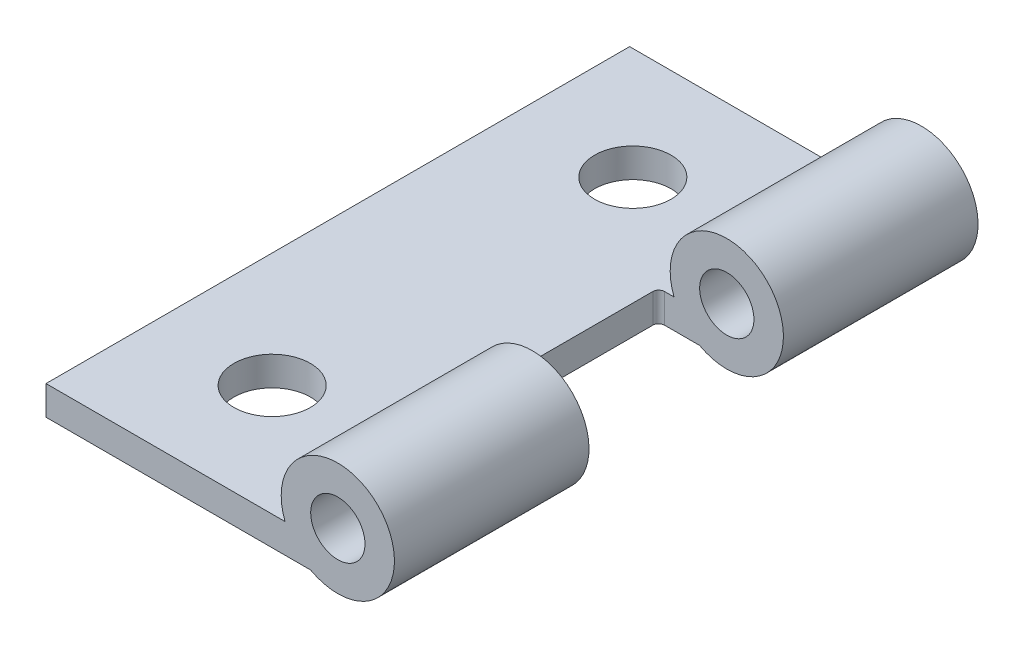
ISO-10303-21;
HEADER;
FILE_DESCRIPTION(('STEP AP214'),'2;1');
FILE_NAME('part.step','',(''),(''),'','','');
FILE_SCHEMA(('AUTOMOTIVE_DESIGN { 1 0 10303 214 1 1 1 1 }'));
ENDSEC;
DATA;
#1=APPLICATION_CONTEXT('core data for automotive mechanical design processes');
#2=APPLICATION_PROTOCOL_DEFINITION('international standard','automotive_design',2000,#1);
#3=PRODUCT_CONTEXT('',#1,'mechanical');
#4=PRODUCT('Part','Part','',(#3));
#5=PRODUCT_RELATED_PRODUCT_CATEGORY('part','',(#4));
#6=PRODUCT_DEFINITION_FORMATION('','',#4);
#7=PRODUCT_DEFINITION_CONTEXT('part definition',#1,'design');
#8=PRODUCT_DEFINITION('design','',#6,#7);
#9=PRODUCT_DEFINITION_SHAPE('','',#8);
#10=(LENGTH_UNIT() NAMED_UNIT(*) SI_UNIT(.MILLI.,.METRE.));
#11=(NAMED_UNIT(*) PLANE_ANGLE_UNIT() SI_UNIT($,.RADIAN.));
#12=(NAMED_UNIT(*) SI_UNIT($,.STERADIAN.) SOLID_ANGLE_UNIT());
#13=UNCERTAINTY_MEASURE_WITH_UNIT(LENGTH_MEASURE(1.E-05),#10,'distance_accuracy_value','');
#14=(GEOMETRIC_REPRESENTATION_CONTEXT(3) GLOBAL_UNCERTAINTY_ASSIGNED_CONTEXT((#13)) GLOBAL_UNIT_ASSIGNED_CONTEXT((#10,
#11,#12)) REPRESENTATION_CONTEXT('',''));
#15=CARTESIAN_POINT('',(0.,0.,0.));
#16=DIRECTION('',(0.,0.,1.));
#17=DIRECTION('',(1.,0.,0.));
#18=AXIS2_PLACEMENT_3D('',#15,#16,#17);
#19=CARTESIAN_POINT('',(-17.6276,2.61457636807809,-12.7));
#20=DIRECTION('',(0.,-1.,0.));
#21=DIRECTION('',(1.,0.,0.));
#22=AXIS2_PLACEMENT_3D('',#19,#20,#21);
#23=PLANE('',#22);
#24=CARTESIAN_POINT('',(-12.6365,2.61457636807809,-7.8486));
#25=DIRECTION('',(0.,-1.,0.));
#26=DIRECTION('',(1.,0.,0.));
#27=AXIS2_PLACEMENT_3D('',#24,#25,#26);
#28=CIRCLE('',#27,1.6637);
#29=CARTESIAN_POINT('',(-10.9728,2.6145763680781,-7.8486));
#30=VERTEX_POINT('',#29);
#31=EDGE_CURVE('E276',#30,#30,#28,.T.);
#32=ORIENTED_EDGE('',*,*,#31,.F.);
#33=EDGE_LOOP('',(#32));
#34=FACE_BOUND('',#33,.T.);
#35=CARTESIAN_POINT('',(-12.6365,2.61457636807809,7.8486));
#36=DIRECTION('',(0.,-1.,0.));
#37=DIRECTION('',(1.,0.,0.));
#38=AXIS2_PLACEMENT_3D('',#35,#36,#37);
#39=CIRCLE('',#38,1.6637);
#40=CARTESIAN_POINT('',(-10.9728,2.6145763680781,7.8486));
#41=VERTEX_POINT('',#40);
#42=EDGE_CURVE('E278',#41,#41,#39,.T.);
#43=ORIENTED_EDGE('',*,*,#42,.F.);
#44=EDGE_LOOP('',(#43));
#45=FACE_BOUND('',#44,.T.);
#46=DIRECTION('',(0.,0.,-1.));
#47=VECTOR('',#46,1.);
#48=CARTESIAN_POINT('',(-7.89178,2.61457636807809,4.2291));
#49=LINE('',#48,#47);
#50=CARTESIAN_POINT('',(-7.89178,2.61457636807809,3.9751));
#51=VERTEX_POINT('',#50);
#52=CARTESIAN_POINT('',(-7.89178,2.61457636807809,-3.9751));
#53=VERTEX_POINT('',#52);
#54=EDGE_CURVE('E141',#51,#53,#49,.T.);
#55=ORIENTED_EDGE('',*,*,#54,.F.);
#56=CARTESIAN_POINT('',(-7.63778,2.6145763680781,3.9751));
#57=DIRECTION('',(0.,-1.,0.));
#58=DIRECTION('',(1.,0.,0.));
#59=AXIS2_PLACEMENT_3D('',#56,#57,#58);
#60=CIRCLE('',#59,0.254);
#61=CARTESIAN_POINT('',(-7.63778,2.61457636807809,4.2291));
#62=VERTEX_POINT('',#61);
#63=EDGE_CURVE('E45',#51,#62,#60,.F.);
#64=ORIENTED_EDGE('',*,*,#63,.T.);
#65=DIRECTION('',(1.,0.,0.));
#66=VECTOR('',#65,1.);
#67=CARTESIAN_POINT('',(-7.89178,2.61457636807809,4.2291));
#68=LINE('',#67,#66);
#69=CARTESIAN_POINT('',(-6.10869999999999,2.6145763680781,4.2291));
#70=VERTEX_POINT('',#69);
#71=EDGE_CURVE('E207',#62,#70,#68,.T.);
#72=ORIENTED_EDGE('',*,*,#71,.T.);
#73=DIRECTION('',(0.,0.,1.));
#74=VECTOR('',#73,1.);
#75=CARTESIAN_POINT('',(-6.1087,2.6145763680781,-12.7));
#76=LINE('',#75,#74);
#77=CARTESIAN_POINT('',(-6.1087,2.6145763680781,4.23291));
#78=VERTEX_POINT('',#77);
#79=EDGE_CURVE('E160',#70,#78,#76,.T.);
#80=ORIENTED_EDGE('',*,*,#79,.T.);
#81=CARTESIAN_POINT('',(-6.1087,2.6145763680781,12.7));
#82=VERTEX_POINT('',#81);
#83=EDGE_CURVE('E161',#78,#82,#76,.T.);
#84=ORIENTED_EDGE('',*,*,#83,.T.);
#85=DIRECTION('',(1.,0.,0.));
#86=VECTOR('',#85,1.);
#87=CARTESIAN_POINT('',(-17.6276,2.61457636807809,12.7));
#88=LINE('',#87,#86);
#89=CARTESIAN_POINT('',(-17.6276,2.61457636807809,12.7));
#90=VERTEX_POINT('',#89);
#91=EDGE_CURVE('E220',#90,#82,#88,.T.);
#92=ORIENTED_EDGE('',*,*,#91,.F.);
#93=DIRECTION('',(0.,0.,1.));
#94=VECTOR('',#93,1.);
#95=CARTESIAN_POINT('',(-17.6276,2.61457636807809,-12.7));
#96=LINE('',#95,#94);
#97=CARTESIAN_POINT('',(-17.6276,2.61457636807809,-12.7));
#98=VERTEX_POINT('',#97);
#99=EDGE_CURVE('E151',#98,#90,#96,.T.);
#100=ORIENTED_EDGE('',*,*,#99,.F.);
#101=DIRECTION('',(1.,0.,0.));
#102=VECTOR('',#101,1.);
#103=CARTESIAN_POINT('',(-17.6276,2.61457636807809,-12.7));
#104=LINE('',#103,#102);
#105=CARTESIAN_POINT('',(-6.1087,2.6145763680781,-12.7));
#106=VERTEX_POINT('',#105);
#107=EDGE_CURVE('E233',#98,#106,#104,.T.);
#108=ORIENTED_EDGE('',*,*,#107,.T.);
#109=CARTESIAN_POINT('',(-6.1087,2.6145763680781,-4.2291));
#110=VERTEX_POINT('',#109);
#111=EDGE_CURVE('E154',#106,#110,#76,.T.);
#112=ORIENTED_EDGE('',*,*,#111,.T.);
#113=DIRECTION('',(1.,0.,0.));
#114=VECTOR('',#113,1.);
#115=CARTESIAN_POINT('',(-7.89178,2.61457636807809,-4.2291));
#116=LINE('',#115,#114);
#117=CARTESIAN_POINT('',(-7.63778,2.61457636807809,-4.2291));
#118=VERTEX_POINT('',#117);
#119=EDGE_CURVE('E126',#118,#110,#116,.T.);
#120=ORIENTED_EDGE('',*,*,#119,.F.);
#121=CARTESIAN_POINT('',(-7.63778,2.6145763680781,-3.9751));
#122=DIRECTION('',(0.,-1.,0.));
#123=DIRECTION('',(1.,0.,0.));
#124=AXIS2_PLACEMENT_3D('',#121,#122,#123);
#125=CIRCLE('',#124,0.254);
#126=EDGE_CURVE('E193',#118,#53,#125,.F.);
#127=ORIENTED_EDGE('',*,*,#126,.T.);
#128=EDGE_LOOP('',(#55,#64,#72,#80,#84,#92,#100,#108,#112,#120,#127));
#129=FACE_BOUND('',#128,.T.);
#130=ADVANCED_FACE('F37',(#34,#45,#129),#23,.T.);
#131=CARTESIAN_POINT('',(-17.6276,3.88457636807809,-12.7));
#132=DIRECTION('',(0.,1.,0.));
#133=DIRECTION('',(-1.,0.,0.));
#134=AXIS2_PLACEMENT_3D('',#131,#132,#133);
#135=PLANE('',#134);
#136=CARTESIAN_POINT('',(-12.6365,3.88457636807809,-7.8486));
#137=DIRECTION('',(0.,1.,0.));
#138=DIRECTION('',(-1.,0.,0.));
#139=AXIS2_PLACEMENT_3D('',#136,#137,#138);
#140=CIRCLE('',#139,1.6637);
#141=CARTESIAN_POINT('',(-14.3002,3.88457636807809,-7.8486));
#142=VERTEX_POINT('',#141);
#143=EDGE_CURVE('E283',#142,#142,#140,.T.);
#144=ORIENTED_EDGE('',*,*,#143,.F.);
#145=EDGE_LOOP('',(#144));
#146=FACE_BOUND('',#145,.T.);
#147=CARTESIAN_POINT('',(-12.6365,3.88457636807809,7.8486));
#148=DIRECTION('',(0.,1.,0.));
#149=DIRECTION('',(-1.,0.,0.));
#150=AXIS2_PLACEMENT_3D('',#147,#148,#149);
#151=CIRCLE('',#150,1.6637);
#152=CARTESIAN_POINT('',(-14.3002,3.88457636807809,7.8486));
#153=VERTEX_POINT('',#152);
#154=EDGE_CURVE('E284',#153,#153,#151,.T.);
#155=ORIENTED_EDGE('',*,*,#154,.F.);
#156=EDGE_LOOP('',(#155));
#157=FACE_BOUND('',#156,.T.);
#158=DIRECTION('',(0.,0.,1.));
#159=VECTOR('',#158,1.);
#160=CARTESIAN_POINT('',(-7.22416379405477,3.8845763680781,-12.7));
#161=LINE('',#160,#159);
#162=CARTESIAN_POINT('',(-7.22416379405477,3.8845763680781,4.2291));
#163=VERTEX_POINT('',#162);
#164=CARTESIAN_POINT('',(-7.22416379405477,3.8845763680781,4.23291));
#165=VERTEX_POINT('',#164);
#166=EDGE_CURVE('E148',#163,#165,#161,.T.);
#167=ORIENTED_EDGE('',*,*,#166,.F.);
#168=DIRECTION('',(-1.,0.,0.));
#169=VECTOR('',#168,1.);
#170=CARTESIAN_POINT('',(-17.6276,3.88457636807809,4.2291));
#171=LINE('',#170,#169);
#172=CARTESIAN_POINT('',(-7.63778,3.8845763680781,4.2291));
#173=VERTEX_POINT('',#172);
#174=EDGE_CURVE('E131',#163,#173,#171,.T.);
#175=ORIENTED_EDGE('',*,*,#174,.T.);
#176=CARTESIAN_POINT('',(-7.63778,3.8845763680781,3.9751));
#177=DIRECTION('',(0.,1.,0.));
#178=DIRECTION('',(-1.,0.,0.));
#179=AXIS2_PLACEMENT_3D('',#176,#177,#178);
#180=CIRCLE('',#179,0.254);
#181=CARTESIAN_POINT('',(-7.89178,3.8845763680781,3.9751));
#182=VERTEX_POINT('',#181);
#183=EDGE_CURVE('E11',#173,#182,#180,.F.);
#184=ORIENTED_EDGE('',*,*,#183,.T.);
#185=DIRECTION('',(0.,0.,-1.));
#186=VECTOR('',#185,1.);
#187=CARTESIAN_POINT('',(-7.89178,3.8845763680781,-12.7));
#188=LINE('',#187,#186);
#189=CARTESIAN_POINT('',(-7.89178,3.8845763680781,-3.9751));
#190=VERTEX_POINT('',#189);
#191=EDGE_CURVE('E179',#182,#190,#188,.T.);
#192=ORIENTED_EDGE('',*,*,#191,.T.);
#193=CARTESIAN_POINT('',(-7.63778,3.8845763680781,-3.9751));
#194=DIRECTION('',(0.,1.,0.));
#195=DIRECTION('',(-1.,0.,0.));
#196=AXIS2_PLACEMENT_3D('',#193,#194,#195);
#197=CIRCLE('',#196,0.254);
#198=CARTESIAN_POINT('',(-7.63778,3.8845763680781,-4.2291));
#199=VERTEX_POINT('',#198);
#200=EDGE_CURVE('E140',#190,#199,#197,.F.);
#201=ORIENTED_EDGE('',*,*,#200,.T.);
#202=DIRECTION('',(-1.,0.,0.));
#203=VECTOR('',#202,1.);
#204=CARTESIAN_POINT('',(-17.6276,3.88457636807809,-4.2291));
#205=LINE('',#204,#203);
#206=CARTESIAN_POINT('',(-7.22416379405477,3.8845763680781,-4.2291));
#207=VERTEX_POINT('',#206);
#208=EDGE_CURVE('E123',#207,#199,#205,.T.);
#209=ORIENTED_EDGE('',*,*,#208,.F.);
#210=CARTESIAN_POINT('',(-7.22416379405477,3.8845763680781,-12.7));
#211=VERTEX_POINT('',#210);
#212=EDGE_CURVE('E137',#211,#207,#161,.T.);
#213=ORIENTED_EDGE('',*,*,#212,.F.);
#214=DIRECTION('',(-1.,0.,0.));
#215=VECTOR('',#214,1.);
#216=CARTESIAN_POINT('',(-17.6276,3.88457636807809,-12.7));
#217=LINE('',#216,#215);
#218=CARTESIAN_POINT('',(-17.6276,3.88457636807809,-12.7));
#219=VERTEX_POINT('',#218);
#220=EDGE_CURVE('E168',#211,#219,#217,.T.);
#221=ORIENTED_EDGE('',*,*,#220,.T.);
#222=DIRECTION('',(0.,0.,1.));
#223=VECTOR('',#222,1.);
#224=CARTESIAN_POINT('',(-17.6276,3.88457636807809,-12.7));
#225=LINE('',#224,#223);
#226=CARTESIAN_POINT('',(-17.6276,3.88457636807809,12.7));
#227=VERTEX_POINT('',#226);
#228=EDGE_CURVE('E147',#219,#227,#225,.T.);
#229=ORIENTED_EDGE('',*,*,#228,.T.);
#230=DIRECTION('',(-1.,0.,0.));
#231=VECTOR('',#230,1.);
#232=CARTESIAN_POINT('',(-17.6276,3.88457636807809,12.7));
#233=LINE('',#232,#231);
#234=CARTESIAN_POINT('',(-7.22416379405477,3.8845763680781,12.7));
#235=VERTEX_POINT('',#234);
#236=EDGE_CURVE('E225',#235,#227,#233,.T.);
#237=ORIENTED_EDGE('',*,*,#236,.F.);
#238=EDGE_CURVE('E150',#165,#235,#161,.T.);
#239=ORIENTED_EDGE('',*,*,#238,.F.);
#240=EDGE_LOOP('',(#167,#175,#184,#192,#201,#209,#213,#221,#229,#237,#239));
#241=FACE_BOUND('',#240,.T.);
#242=ADVANCED_FACE('F135',(#146,#157,#241),#135,.T.);
#243=CARTESIAN_POINT('',(-4.9276,4.7768236319219,4.23291));
#244=DIRECTION('',(0.,0.,-1.));
#245=DIRECTION('',(-1.,0.,0.));
#246=AXIS2_PLACEMENT_3D('',#243,#244,#245);
#247=CYLINDRICAL_SURFACE('',#246,2.4638);
#248=ORIENTED_EDGE('',*,*,#79,.F.);
#249=CARTESIAN_POINT('',(-4.9276,4.7768236319219,4.2291));
#250=DIRECTION('',(0.,0.,-1.));
#251=DIRECTION('',(-1.,0.,0.));
#252=AXIS2_PLACEMENT_3D('',#249,#250,#251);
#253=CIRCLE('',#252,2.4638);
#254=EDGE_CURVE('E175',#70,#163,#253,.T.);
#255=ORIENTED_EDGE('',*,*,#254,.T.);
#256=ORIENTED_EDGE('',*,*,#166,.T.);
#257=CARTESIAN_POINT('',(-4.9276,4.7768236319219,4.23291));
#258=DIRECTION('',(0.,0.,1.));
#259=DIRECTION('',(1.,0.,0.));
#260=AXIS2_PLACEMENT_3D('',#257,#258,#259);
#261=CIRCLE('',#260,2.4638);
#262=EDGE_CURVE('E213',#165,#78,#261,.T.);
#263=ORIENTED_EDGE('',*,*,#262,.T.);
#264=EDGE_LOOP('',(#248,#255,#256,#263));
#265=FACE_BOUND('',#264,.T.);
#266=ADVANCED_FACE('F262',(#265),#247,.F.);
#267=CARTESIAN_POINT('',(-4.9276,4.7768236319219,-12.7));
#268=DIRECTION('',(0.,0.,1.));
#269=DIRECTION('',(1.,0.,0.));
#270=AXIS2_PLACEMENT_3D('',#267,#268,#269);
#271=CYLINDRICAL_SURFACE('',#270,2.4638);
#272=ORIENTED_EDGE('',*,*,#212,.T.);
#273=CARTESIAN_POINT('',(-4.9276,4.7768236319219,-4.2291));
#274=DIRECTION('',(0.,0.,1.));
#275=DIRECTION('',(1.,0.,0.));
#276=AXIS2_PLACEMENT_3D('',#273,#274,#275);
#277=CIRCLE('',#276,2.4638);
#278=EDGE_CURVE('E118',#110,#207,#277,.T.);
#279=ORIENTED_EDGE('',*,*,#278,.F.);
#280=ORIENTED_EDGE('',*,*,#111,.F.);
#281=CARTESIAN_POINT('',(-4.9276,4.7768236319219,-12.7));
#282=DIRECTION('',(0.,0.,1.));
#283=DIRECTION('',(1.,0.,0.));
#284=AXIS2_PLACEMENT_3D('',#281,#282,#283);
#285=CIRCLE('',#284,2.4638);
#286=EDGE_CURVE('E146',#106,#211,#285,.T.);
#287=ORIENTED_EDGE('',*,*,#286,.T.);
#288=EDGE_LOOP('',(#272,#279,#280,#287));
#289=FACE_BOUND('',#288,.T.);
#290=ADVANCED_FACE('F144',(#289),#271,.T.);
#291=CARTESIAN_POINT('',(-4.9276,4.7768236319219,-12.7));
#292=DIRECTION('',(0.,0.,1.));
#293=DIRECTION('',(1.,0.,0.));
#294=AXIS2_PLACEMENT_3D('',#291,#292,#293);
#295=CYLINDRICAL_SURFACE('',#294,1.1811);
#296=CARTESIAN_POINT('',(-4.9276,4.7768236319219,-12.7));
#297=DIRECTION('',(0.,0.,1.));
#298=DIRECTION('',(-1.,0.,0.));
#299=AXIS2_PLACEMENT_3D('',#296,#297,#298);
#300=CIRCLE('',#299,1.1811);
#301=CARTESIAN_POINT('',(-6.1087,4.7768236319219,-12.7));
#302=VERTEX_POINT('',#301);
#303=EDGE_CURVE('E230',#302,#302,#300,.T.);
#304=ORIENTED_EDGE('',*,*,#303,.F.);
#305=EDGE_LOOP('',(#304));
#306=FACE_BOUND('',#305,.T.);
#307=CARTESIAN_POINT('',(-4.9276,4.7768236319219,-4.2291));
#308=DIRECTION('',(0.,0.,1.));
#309=DIRECTION('',(1.,0.,0.));
#310=AXIS2_PLACEMENT_3D('',#307,#308,#309);
#311=CIRCLE('',#310,1.1811);
#312=CARTESIAN_POINT('',(-3.7465,4.7768236319219,-4.2291));
#313=VERTEX_POINT('',#312);
#314=EDGE_CURVE('E216',#313,#313,#311,.F.);
#315=ORIENTED_EDGE('',*,*,#314,.F.);
#316=EDGE_LOOP('',(#315));
#317=FACE_BOUND('',#316,.T.);
#318=ADVANCED_FACE('F244',(#306,#317),#295,.F.);
#319=CARTESIAN_POINT('',(-17.6276,2.61457636807809,-12.7));
#320=DIRECTION('',(-1.,0.,0.));
#321=DIRECTION('',(0.,0.,1.));
#322=AXIS2_PLACEMENT_3D('',#319,#320,#321);
#323=PLANE('',#322);
#324=ORIENTED_EDGE('',*,*,#99,.T.);
#325=DIRECTION('',(0.,-1.,0.));
#326=VECTOR('',#325,1.);
#327=CARTESIAN_POINT('',(-17.6276,2.61457636807809,12.7));
#328=LINE('',#327,#326);
#329=EDGE_CURVE('E228',#227,#90,#328,.T.);
#330=ORIENTED_EDGE('',*,*,#329,.F.);
#331=ORIENTED_EDGE('',*,*,#228,.F.);
#332=DIRECTION('',(0.,-1.,0.));
#333=VECTOR('',#332,1.);
#334=CARTESIAN_POINT('',(-17.6276,2.61457636807809,-12.7));
#335=LINE('',#334,#333);
#336=EDGE_CURVE('E164',#219,#98,#335,.T.);
#337=ORIENTED_EDGE('',*,*,#336,.T.);
#338=EDGE_LOOP('',(#324,#330,#331,#337));
#339=FACE_BOUND('',#338,.T.);
#340=ADVANCED_FACE('F241',(#339),#323,.T.);
#341=EDGE_CURVE('E130',#78,#165,#261,.T.);
#342=ORIENTED_EDGE('',*,*,#341,.T.);
#343=ORIENTED_EDGE('',*,*,#238,.T.);
#344=CARTESIAN_POINT('',(-4.9276,4.7768236319219,12.7));
#345=DIRECTION('',(0.,0.,1.));
#346=DIRECTION('',(1.,0.,0.));
#347=AXIS2_PLACEMENT_3D('',#344,#345,#346);
#348=CIRCLE('',#347,2.4638);
#349=EDGE_CURVE('E223',#82,#235,#348,.T.);
#350=ORIENTED_EDGE('',*,*,#349,.F.);
#351=ORIENTED_EDGE('',*,*,#83,.F.);
#352=EDGE_LOOP('',(#342,#343,#350,#351));
#353=FACE_BOUND('',#352,.T.);
#354=ADVANCED_FACE('F243',(#353),#271,.T.);
#355=CARTESIAN_POINT('',(-4.9276,4.7768236319219,-12.7));
#356=DIRECTION('',(0.,0.,1.));
#357=DIRECTION('',(1.,0.,0.));
#358=AXIS2_PLACEMENT_3D('',#355,#356,#357);
#359=PLANE('',#358);
#360=ORIENTED_EDGE('',*,*,#303,.T.);
#361=EDGE_LOOP('',(#360));
#362=FACE_BOUND('',#361,.T.);
#363=ORIENTED_EDGE('',*,*,#107,.F.);
#364=ORIENTED_EDGE('',*,*,#336,.F.);
#365=ORIENTED_EDGE('',*,*,#220,.F.);
#366=ORIENTED_EDGE('',*,*,#286,.F.);
#367=EDGE_LOOP('',(#363,#364,#365,#366));
#368=FACE_BOUND('',#367,.T.);
#369=ADVANCED_FACE('F236',(#362,#368),#359,.F.);
#370=CARTESIAN_POINT('',(-4.9276,4.7768236319219,4.23291));
#371=DIRECTION('',(0.,0.,1.));
#372=DIRECTION('',(1.,0.,0.));
#373=AXIS2_PLACEMENT_3D('',#370,#371,#372);
#374=CIRCLE('',#373,1.1811);
#375=CARTESIAN_POINT('',(-3.7465,4.7768236319219,4.23291));
#376=VERTEX_POINT('',#375);
#377=EDGE_CURVE('E187',#376,#376,#374,.F.);
#378=ORIENTED_EDGE('',*,*,#377,.T.);
#379=EDGE_LOOP('',(#378));
#380=FACE_BOUND('',#379,.T.);
#381=CARTESIAN_POINT('',(-4.9276,4.7768236319219,12.7));
#382=DIRECTION('',(0.,0.,1.));
#383=DIRECTION('',(-1.,0.,0.));
#384=AXIS2_PLACEMENT_3D('',#381,#382,#383);
#385=CIRCLE('',#384,1.1811);
#386=CARTESIAN_POINT('',(-6.1087,4.7768236319219,12.7));
#387=VERTEX_POINT('',#386);
#388=EDGE_CURVE('E217',#387,#387,#385,.T.);
#389=ORIENTED_EDGE('',*,*,#388,.T.);
#390=EDGE_LOOP('',(#389));
#391=FACE_BOUND('',#390,.T.);
#392=ADVANCED_FACE('F253',(#380,#391),#295,.F.);
#393=CARTESIAN_POINT('',(-4.9276,4.7768236319219,12.7));
#394=DIRECTION('',(0.,0.,1.));
#395=DIRECTION('',(1.,0.,0.));
#396=AXIS2_PLACEMENT_3D('',#393,#394,#395);
#397=PLANE('',#396);
#398=ORIENTED_EDGE('',*,*,#91,.T.);
#399=ORIENTED_EDGE('',*,*,#349,.T.);
#400=ORIENTED_EDGE('',*,*,#236,.T.);
#401=ORIENTED_EDGE('',*,*,#329,.T.);
#402=EDGE_LOOP('',(#398,#399,#400,#401));
#403=FACE_BOUND('',#402,.T.);
#404=ORIENTED_EDGE('',*,*,#388,.F.);
#405=EDGE_LOOP('',(#404));
#406=FACE_BOUND('',#405,.T.);
#407=ADVANCED_FACE('F239',(#403,#406),#397,.T.);
#408=CARTESIAN_POINT('',(-4.9276,4.7768236319219,4.23291));
#409=DIRECTION('',(0.,0.,1.));
#410=DIRECTION('',(1.,0.,0.));
#411=AXIS2_PLACEMENT_3D('',#408,#409,#410);
#412=PLANE('',#411);
#413=ORIENTED_EDGE('',*,*,#262,.F.);
#414=ORIENTED_EDGE('',*,*,#341,.F.);
#415=EDGE_LOOP('',(#413,#414));
#416=FACE_BOUND('',#415,.T.);
#417=ORIENTED_EDGE('',*,*,#377,.F.);
#418=EDGE_LOOP('',(#417));
#419=FACE_BOUND('',#418,.T.);
#420=ADVANCED_FACE('F307',(#416,#419),#412,.F.);
#421=CARTESIAN_POINT('',(-4.9276,4.7768236319219,-4.2291));
#422=DIRECTION('',(0.,0.,1.));
#423=DIRECTION('',(1.,0.,0.));
#424=AXIS2_PLACEMENT_3D('',#421,#422,#423);
#425=PLANE('',#424);
#426=ORIENTED_EDGE('',*,*,#208,.T.);
#427=DIRECTION('',(0.,-1.,0.));
#428=VECTOR('',#427,1.);
#429=CARTESIAN_POINT('',(-7.63778,2.61457636807809,-4.2291));
#430=LINE('',#429,#428);
#431=EDGE_CURVE('E184',#199,#118,#430,.T.);
#432=ORIENTED_EDGE('',*,*,#431,.T.);
#433=ORIENTED_EDGE('',*,*,#119,.T.);
#434=ORIENTED_EDGE('',*,*,#278,.T.);
#435=EDGE_LOOP('',(#426,#432,#433,#434));
#436=FACE_BOUND('',#435,.T.);
#437=ORIENTED_EDGE('',*,*,#314,.T.);
#438=EDGE_LOOP('',(#437));
#439=FACE_BOUND('',#438,.T.);
#440=ADVANCED_FACE('F120',(#436,#439),#425,.T.);
#441=CARTESIAN_POINT('',(-7.89178,2.61457636807809,4.2291));
#442=DIRECTION('',(1.,0.,0.));
#443=DIRECTION('',(0.,0.,-1.));
#444=AXIS2_PLACEMENT_3D('',#441,#442,#443);
#445=PLANE('',#444);
#446=ORIENTED_EDGE('',*,*,#191,.F.);
#447=DIRECTION('',(0.,-1.,0.));
#448=VECTOR('',#447,1.);
#449=CARTESIAN_POINT('',(-7.89178,2.61457636807809,3.9751));
#450=LINE('',#449,#448);
#451=EDGE_CURVE('E197',#182,#51,#450,.T.);
#452=ORIENTED_EDGE('',*,*,#451,.T.);
#453=ORIENTED_EDGE('',*,*,#54,.T.);
#454=DIRECTION('',(0.,-1.,0.));
#455=VECTOR('',#454,1.);
#456=CARTESIAN_POINT('',(-7.89178,3.8845763680781,-3.9751));
#457=LINE('',#456,#455);
#458=EDGE_CURVE('E190',#53,#190,#457,.F.);
#459=ORIENTED_EDGE('',*,*,#458,.T.);
#460=EDGE_LOOP('',(#446,#452,#453,#459));
#461=FACE_BOUND('',#460,.T.);
#462=ADVANCED_FACE('F203',(#461),#445,.T.);
#463=CARTESIAN_POINT('',(0.,0.,4.2291));
#464=DIRECTION('',(0.,0.,-1.));
#465=DIRECTION('',(-1.,0.,0.));
#466=AXIS2_PLACEMENT_3D('',#463,#464,#465);
#467=PLANE('',#466);
#468=ORIENTED_EDGE('',*,*,#71,.F.);
#469=DIRECTION('',(0.,-1.,0.));
#470=VECTOR('',#469,1.);
#471=CARTESIAN_POINT('',(-7.63778,3.8845763680781,4.2291));
#472=LINE('',#471,#470);
#473=EDGE_CURVE('E52',#62,#173,#472,.F.);
#474=ORIENTED_EDGE('',*,*,#473,.T.);
#475=ORIENTED_EDGE('',*,*,#174,.F.);
#476=ORIENTED_EDGE('',*,*,#254,.F.);
#477=EDGE_LOOP('',(#468,#474,#475,#476));
#478=FACE_BOUND('',#477,.T.);
#479=ADVANCED_FACE('F268',(#478),#467,.T.);
#480=CARTESIAN_POINT('',(-7.63778,4.7768236319219,-3.9751));
#481=DIRECTION('',(0.,1.,0.));
#482=DIRECTION('',(0.,0.,1.));
#483=AXIS2_PLACEMENT_3D('',#480,#481,#482);
#484=CYLINDRICAL_SURFACE('',#483,0.254);
#485=ORIENTED_EDGE('',*,*,#200,.F.);
#486=ORIENTED_EDGE('',*,*,#458,.F.);
#487=ORIENTED_EDGE('',*,*,#126,.F.);
#488=ORIENTED_EDGE('',*,*,#431,.F.);
#489=EDGE_LOOP('',(#485,#486,#487,#488));
#490=FACE_BOUND('',#489,.T.);
#491=ADVANCED_FACE('F266',(#490),#484,.F.);
#492=CARTESIAN_POINT('',(-7.63778,2.61457636807809,3.9751));
#493=DIRECTION('',(0.,1.,0.));
#494=DIRECTION('',(0.,0.,1.));
#495=AXIS2_PLACEMENT_3D('',#492,#493,#494);
#496=CYLINDRICAL_SURFACE('',#495,0.254);
#497=ORIENTED_EDGE('',*,*,#183,.F.);
#498=ORIENTED_EDGE('',*,*,#473,.F.);
#499=ORIENTED_EDGE('',*,*,#63,.F.);
#500=ORIENTED_EDGE('',*,*,#451,.F.);
#501=EDGE_LOOP('',(#497,#498,#499,#500));
#502=FACE_BOUND('',#501,.T.);
#503=ADVANCED_FACE('F39',(#502),#496,.F.);
#504=CARTESIAN_POINT('',(-12.6365,1.34457636807809,7.8486));
#505=DIRECTION('',(0.,1.,0.));
#506=DIRECTION('',(-1.,0.,0.));
#507=AXIS2_PLACEMENT_3D('',#504,#505,#506);
#508=CYLINDRICAL_SURFACE('',#507,1.6637);
#509=ORIENTED_EDGE('',*,*,#42,.T.);
#510=EDGE_LOOP('',(#509));
#511=FACE_BOUND('',#510,.T.);
#512=ORIENTED_EDGE('',*,*,#154,.T.);
#513=EDGE_LOOP('',(#512));
#514=FACE_BOUND('',#513,.T.);
#515=ADVANCED_FACE('F274',(#511,#514),#508,.F.);
#516=CARTESIAN_POINT('',(-12.6365,1.34457636807809,-7.8486));
#517=DIRECTION('',(0.,1.,0.));
#518=DIRECTION('',(-1.,0.,0.));
#519=AXIS2_PLACEMENT_3D('',#516,#517,#518);
#520=CYLINDRICAL_SURFACE('',#519,1.6637);
#521=ORIENTED_EDGE('',*,*,#31,.T.);
#522=EDGE_LOOP('',(#521));
#523=FACE_BOUND('',#522,.T.);
#524=ORIENTED_EDGE('',*,*,#143,.T.);
#525=EDGE_LOOP('',(#524));
#526=FACE_BOUND('',#525,.T.);
#527=ADVANCED_FACE('F290',(#523,#526),#520,.F.);
#528=CLOSED_SHELL('',(#130,#242,#266,#290,#318,#340,#354,#369,#392,#407,#420,#440,#462,#479,
#491,#503,#515,#527));
#529=MANIFOLD_SOLID_BREP('B2',#528);
#530=ADVANCED_BREP_SHAPE_REPRESENTATION('',(#18,#529),#14);
#531=SHAPE_DEFINITION_REPRESENTATION(#9,#530);
ENDSEC;
END-ISO-10303-21;
